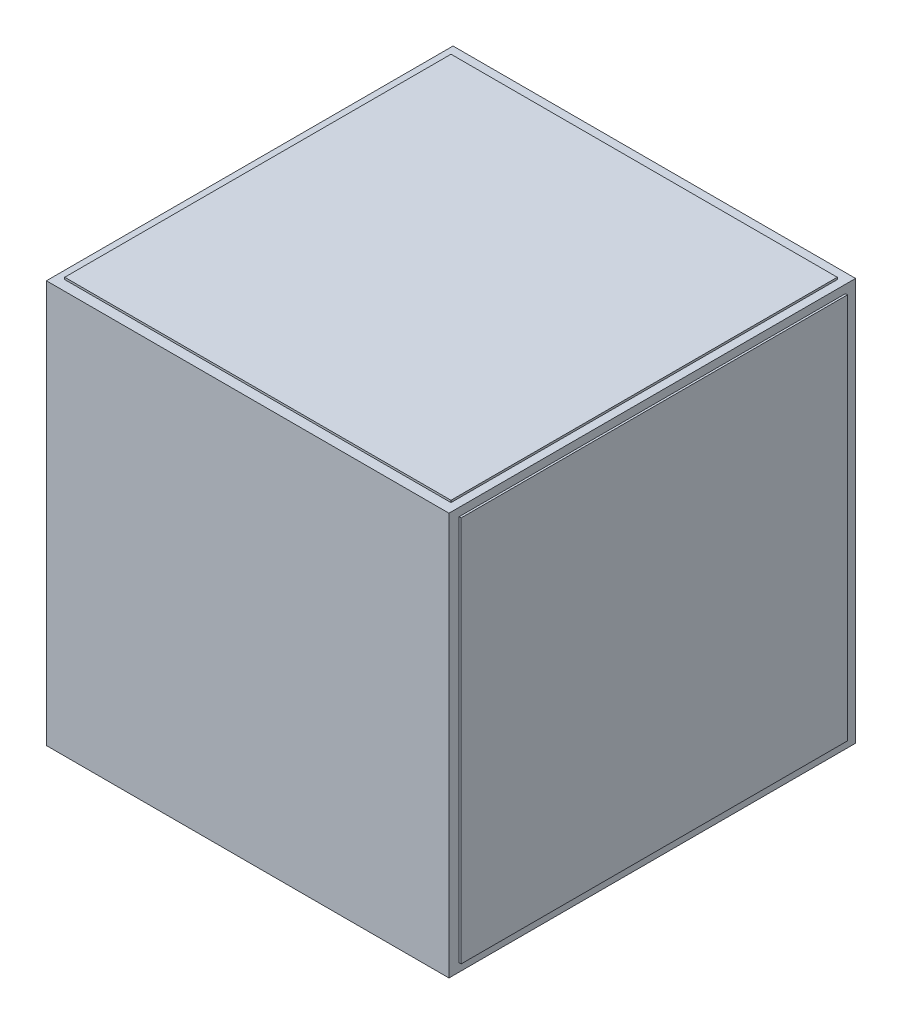
ISO-10303-21;
HEADER;
FILE_DESCRIPTION(('STEP AP214'),'2;1');
FILE_NAME('part.step','',(''),(''),'','','');
FILE_SCHEMA(('AUTOMOTIVE_DESIGN { 1 0 10303 214 1 1 1 1 }'));
ENDSEC;
DATA;
#1=APPLICATION_CONTEXT('core data for automotive mechanical design processes');
#2=APPLICATION_PROTOCOL_DEFINITION('international standard','automotive_design',2000,#1);
#3=PRODUCT_CONTEXT('',#1,'mechanical');
#4=PRODUCT('Part','Part','',(#3));
#5=PRODUCT_RELATED_PRODUCT_CATEGORY('part','',(#4));
#6=PRODUCT_DEFINITION_FORMATION('','',#4);
#7=PRODUCT_DEFINITION_CONTEXT('part definition',#1,'design');
#8=PRODUCT_DEFINITION('design','',#6,#7);
#9=PRODUCT_DEFINITION_SHAPE('','',#8);
#10=(LENGTH_UNIT() NAMED_UNIT(*) SI_UNIT(.MILLI.,.METRE.));
#11=(NAMED_UNIT(*) PLANE_ANGLE_UNIT() SI_UNIT($,.RADIAN.));
#12=(NAMED_UNIT(*) SI_UNIT($,.STERADIAN.) SOLID_ANGLE_UNIT());
#13=UNCERTAINTY_MEASURE_WITH_UNIT(LENGTH_MEASURE(1.E-05),#10,'distance_accuracy_value','');
#14=(GEOMETRIC_REPRESENTATION_CONTEXT(3) GLOBAL_UNCERTAINTY_ASSIGNED_CONTEXT((#13)) GLOBAL_UNIT_ASSIGNED_CONTEXT((#10,
#11,#12)) REPRESENTATION_CONTEXT('',''));
#15=CARTESIAN_POINT('',(0.,0.,0.));
#16=DIRECTION('',(0.,0.,1.));
#17=DIRECTION('',(1.,0.,0.));
#18=AXIS2_PLACEMENT_3D('',#15,#16,#17);
#19=CARTESIAN_POINT('',(0.,0.,0.));
#20=DIRECTION('',(0.,1.,0.));
#21=DIRECTION('',(0.,0.,1.));
#22=AXIS2_PLACEMENT_3D('',#19,#20,#21);
#23=PLANE('',#22);
#24=DIRECTION('',(1.,0.,0.));
#25=VECTOR('',#24,1.);
#26=CARTESIAN_POINT('',(500.000000000002,0.,500.));
#27=LINE('',#26,#25);
#28=CARTESIAN_POINT('',(500.000000000002,0.,500.));
#29=VERTEX_POINT('',#28);
#30=CARTESIAN_POINT('',(19500.,0.,500.));
#31=VERTEX_POINT('',#30);
#32=EDGE_CURVE('E205',#29,#31,#27,.T.);
#33=ORIENTED_EDGE('',*,*,#32,.T.);
#34=DIRECTION('',(0.,0.,1.));
#35=VECTOR('',#34,1.);
#36=CARTESIAN_POINT('',(19500.,0.,19500.));
#37=LINE('',#36,#35);
#38=CARTESIAN_POINT('',(19500.,0.,19500.));
#39=VERTEX_POINT('',#38);
#40=EDGE_CURVE('E208',#31,#39,#37,.T.);
#41=ORIENTED_EDGE('',*,*,#40,.T.);
#42=DIRECTION('',(-1.,0.,0.));
#43=VECTOR('',#42,1.);
#44=CARTESIAN_POINT('',(500.,0.,19500.));
#45=LINE('',#44,#43);
#46=CARTESIAN_POINT('',(500.,0.,19500.));
#47=VERTEX_POINT('',#46);
#48=EDGE_CURVE('E230',#39,#47,#45,.T.);
#49=ORIENTED_EDGE('',*,*,#48,.T.);
#50=DIRECTION('',(0.,0.,-1.));
#51=VECTOR('',#50,1.);
#52=CARTESIAN_POINT('',(500.,0.,19500.));
#53=LINE('',#52,#51);
#54=EDGE_CURVE('E69',#47,#29,#53,.T.);
#55=ORIENTED_EDGE('',*,*,#54,.T.);
#56=EDGE_LOOP('',(#33,#41,#49,#55));
#57=FACE_BOUND('',#56,.T.);
#58=ADVANCED_FACE('F65',(#57),#23,.F.);
#59=CARTESIAN_POINT('',(500.000000000002,20000.,500.));
#60=DIRECTION('',(0.,0.,-1.));
#61=DIRECTION('',(-1.,0.,0.));
#62=AXIS2_PLACEMENT_3D('',#59,#60,#61);
#63=PLANE('',#62);
#64=DIRECTION('',(-1.,0.,0.));
#65=VECTOR('',#64,1.);
#66=CARTESIAN_POINT('',(100.,100.,500.));
#67=LINE('',#66,#65);
#68=CARTESIAN_POINT('',(19500.,100.,500.));
#69=VERTEX_POINT('',#68);
#70=CARTESIAN_POINT('',(500.000000000002,100.000000000001,500.));
#71=VERTEX_POINT('',#70);
#72=EDGE_CURVE('E218',#69,#71,#67,.T.);
#73=ORIENTED_EDGE('',*,*,#72,.F.);
#74=DIRECTION('',(0.,-1.,0.));
#75=VECTOR('',#74,1.);
#76=CARTESIAN_POINT('',(19500.,20000.,500.));
#77=LINE('',#76,#75);
#78=EDGE_CURVE('E215',#69,#31,#77,.T.);
#79=ORIENTED_EDGE('',*,*,#78,.T.);
#80=ORIENTED_EDGE('',*,*,#32,.F.);
#81=DIRECTION('',(0.,-1.,0.));
#82=VECTOR('',#81,1.);
#83=CARTESIAN_POINT('',(500.000000000002,20000.,500.));
#84=LINE('',#83,#82);
#85=EDGE_CURVE('E250',#71,#29,#84,.T.);
#86=ORIENTED_EDGE('',*,*,#85,.F.);
#87=EDGE_LOOP('',(#73,#79,#80,#86));
#88=FACE_BOUND('',#87,.T.);
#89=ADVANCED_FACE('F216',(#88),#63,.T.);
#90=CARTESIAN_POINT('',(19500.,20000.,19500.));
#91=DIRECTION('',(1.,0.,0.));
#92=DIRECTION('',(0.,0.,-1.));
#93=AXIS2_PLACEMENT_3D('',#90,#91,#92);
#94=PLANE('',#93);
#95=DIRECTION('',(0.,0.,-1.));
#96=VECTOR('',#95,1.);
#97=CARTESIAN_POINT('',(19500.,100.,20000.));
#98=LINE('',#97,#96);
#99=CARTESIAN_POINT('',(19500.,100.000000000001,19500.));
#100=VERTEX_POINT('',#99);
#101=EDGE_CURVE('E263',#100,#69,#98,.T.);
#102=ORIENTED_EDGE('',*,*,#101,.F.);
#103=DIRECTION('',(0.,-1.,0.));
#104=VECTOR('',#103,1.);
#105=CARTESIAN_POINT('',(19500.,20000.,19500.));
#106=LINE('',#105,#104);
#107=EDGE_CURVE('E227',#100,#39,#106,.T.);
#108=ORIENTED_EDGE('',*,*,#107,.T.);
#109=ORIENTED_EDGE('',*,*,#40,.F.);
#110=ORIENTED_EDGE('',*,*,#78,.F.);
#111=EDGE_LOOP('',(#102,#108,#109,#110));
#112=FACE_BOUND('',#111,.T.);
#113=ADVANCED_FACE('F226',(#112),#94,.T.);
#114=CARTESIAN_POINT('',(500.,20000.,19500.));
#115=DIRECTION('',(0.,0.,1.));
#116=DIRECTION('',(1.,0.,0.));
#117=AXIS2_PLACEMENT_3D('',#114,#115,#116);
#118=PLANE('',#117);
#119=DIRECTION('',(1.,0.,0.));
#120=VECTOR('',#119,1.);
#121=CARTESIAN_POINT('',(100.,100.,19500.));
#122=LINE('',#121,#120);
#123=CARTESIAN_POINT('',(500.,100.000000000001,19500.));
#124=VERTEX_POINT('',#123);
#125=EDGE_CURVE('E266',#124,#100,#122,.T.);
#126=ORIENTED_EDGE('',*,*,#125,.F.);
#127=DIRECTION('',(0.,-1.,0.));
#128=VECTOR('',#127,1.);
#129=CARTESIAN_POINT('',(500.,20000.,19500.));
#130=LINE('',#129,#128);
#131=EDGE_CURVE('E256',#124,#47,#130,.T.);
#132=ORIENTED_EDGE('',*,*,#131,.T.);
#133=ORIENTED_EDGE('',*,*,#48,.F.);
#134=ORIENTED_EDGE('',*,*,#107,.F.);
#135=EDGE_LOOP('',(#126,#132,#133,#134));
#136=FACE_BOUND('',#135,.T.);
#137=ADVANCED_FACE('F464',(#136),#118,.T.);
#138=CARTESIAN_POINT('',(500.,20000.,19500.));
#139=DIRECTION('',(-1.,0.,0.));
#140=DIRECTION('',(0.,0.,1.));
#141=AXIS2_PLACEMENT_3D('',#138,#139,#140);
#142=PLANE('',#141);
#143=DIRECTION('',(0.,0.,1.));
#144=VECTOR('',#143,1.);
#145=CARTESIAN_POINT('',(500.,100.,20000.));
#146=LINE('',#145,#144);
#147=EDGE_CURVE('E270',#71,#124,#146,.T.);
#148=ORIENTED_EDGE('',*,*,#147,.F.);
#149=ORIENTED_EDGE('',*,*,#85,.T.);
#150=ORIENTED_EDGE('',*,*,#54,.F.);
#151=ORIENTED_EDGE('',*,*,#131,.F.);
#152=EDGE_LOOP('',(#148,#149,#150,#151));
#153=FACE_BOUND('',#152,.T.);
#154=ADVANCED_FACE('F462',(#153),#142,.T.);
#155=DIRECTION('',(0.,0.,-1.));
#156=VECTOR('',#155,1.);
#157=CARTESIAN_POINT('',(500.,19900.,20000.));
#158=LINE('',#157,#156);
#159=CARTESIAN_POINT('',(500.,19900.,19500.));
#160=VERTEX_POINT('',#159);
#161=CARTESIAN_POINT('',(500.000000000002,19900.,500.));
#162=VERTEX_POINT('',#161);
#163=EDGE_CURVE('E393',#160,#162,#158,.T.);
#164=ORIENTED_EDGE('',*,*,#163,.F.);
#165=CARTESIAN_POINT('',(500.,20000.,19500.));
#166=VERTEX_POINT('',#165);
#167=EDGE_CURVE('E260',#166,#160,#130,.T.);
#168=ORIENTED_EDGE('',*,*,#167,.F.);
#169=DIRECTION('',(0.,0.,-1.));
#170=VECTOR('',#169,1.);
#171=CARTESIAN_POINT('',(500.,20000.,19500.));
#172=LINE('',#171,#170);
#173=CARTESIAN_POINT('',(500.000000000002,20000.,500.));
#174=VERTEX_POINT('',#173);
#175=EDGE_CURVE('E233',#166,#174,#172,.T.);
#176=ORIENTED_EDGE('',*,*,#175,.T.);
#177=EDGE_CURVE('E224',#174,#162,#84,.T.);
#178=ORIENTED_EDGE('',*,*,#177,.T.);
#179=EDGE_LOOP('',(#164,#168,#176,#178));
#180=FACE_BOUND('',#179,.T.);
#181=ADVANCED_FACE('F470',(#180),#142,.T.);
#182=DIRECTION('',(-1.,0.,0.));
#183=VECTOR('',#182,1.);
#184=CARTESIAN_POINT('',(100.,19900.,19500.));
#185=LINE('',#184,#183);
#186=CARTESIAN_POINT('',(19500.,19900.,19500.));
#187=VERTEX_POINT('',#186);
#188=EDGE_CURVE('E389',#187,#160,#185,.T.);
#189=ORIENTED_EDGE('',*,*,#188,.F.);
#190=CARTESIAN_POINT('',(19500.,20000.,19500.));
#191=VERTEX_POINT('',#190);
#192=EDGE_CURVE('E255',#191,#187,#106,.T.);
#193=ORIENTED_EDGE('',*,*,#192,.F.);
#194=DIRECTION('',(-1.,0.,0.));
#195=VECTOR('',#194,1.);
#196=CARTESIAN_POINT('',(500.,20000.,19500.));
#197=LINE('',#196,#195);
#198=EDGE_CURVE('E246',#191,#166,#197,.T.);
#199=ORIENTED_EDGE('',*,*,#198,.T.);
#200=ORIENTED_EDGE('',*,*,#167,.T.);
#201=EDGE_LOOP('',(#189,#193,#199,#200));
#202=FACE_BOUND('',#201,.T.);
#203=ADVANCED_FACE('F440',(#202),#118,.T.);
#204=DIRECTION('',(0.,0.,1.));
#205=VECTOR('',#204,1.);
#206=CARTESIAN_POINT('',(19500.,19900.,20000.));
#207=LINE('',#206,#205);
#208=CARTESIAN_POINT('',(19500.,19900.,500.));
#209=VERTEX_POINT('',#208);
#210=EDGE_CURVE('E385',#209,#187,#207,.T.);
#211=ORIENTED_EDGE('',*,*,#210,.F.);
#212=CARTESIAN_POINT('',(19500.,20000.,500.));
#213=VERTEX_POINT('',#212);
#214=EDGE_CURVE('E223',#213,#209,#77,.T.);
#215=ORIENTED_EDGE('',*,*,#214,.F.);
#216=DIRECTION('',(0.,0.,1.));
#217=VECTOR('',#216,1.);
#218=CARTESIAN_POINT('',(19500.,20000.,19500.));
#219=LINE('',#218,#217);
#220=EDGE_CURVE('E242',#213,#191,#219,.T.);
#221=ORIENTED_EDGE('',*,*,#220,.T.);
#222=ORIENTED_EDGE('',*,*,#192,.T.);
#223=EDGE_LOOP('',(#211,#215,#221,#222));
#224=FACE_BOUND('',#223,.T.);
#225=ADVANCED_FACE('F472',(#224),#94,.T.);
#226=DIRECTION('',(1.,0.,0.));
#227=VECTOR('',#226,1.);
#228=CARTESIAN_POINT('',(100.,19900.,500.));
#229=LINE('',#228,#227);
#230=EDGE_CURVE('E381',#162,#209,#229,.T.);
#231=ORIENTED_EDGE('',*,*,#230,.F.);
#232=ORIENTED_EDGE('',*,*,#177,.F.);
#233=DIRECTION('',(1.,0.,0.));
#234=VECTOR('',#233,1.);
#235=CARTESIAN_POINT('',(500.000000000002,20000.,500.));
#236=LINE('',#235,#234);
#237=EDGE_CURVE('E238',#174,#213,#236,.T.);
#238=ORIENTED_EDGE('',*,*,#237,.T.);
#239=ORIENTED_EDGE('',*,*,#214,.T.);
#240=EDGE_LOOP('',(#231,#232,#238,#239));
#241=FACE_BOUND('',#240,.T.);
#242=ADVANCED_FACE('F437',(#241),#63,.T.);
#243=CARTESIAN_POINT('',(20000.,19500.,19500.));
#244=DIRECTION('',(0.,1.,0.));
#245=DIRECTION('',(0.,0.,1.));
#246=AXIS2_PLACEMENT_3D('',#243,#244,#245);
#247=PLANE('',#246);
#248=DIRECTION('',(0.,0.,-1.));
#249=VECTOR('',#248,1.);
#250=CARTESIAN_POINT('',(19900.,19500.,20000.));
#251=LINE('',#250,#249);
#252=CARTESIAN_POINT('',(19900.,19500.,19500.));
#253=VERTEX_POINT('',#252);
#254=CARTESIAN_POINT('',(19900.,19500.,500.));
#255=VERTEX_POINT('',#254);
#256=EDGE_CURVE('E307',#253,#255,#251,.T.);
#257=ORIENTED_EDGE('',*,*,#256,.F.);
#258=DIRECTION('',(-1.,0.,0.));
#259=VECTOR('',#258,1.);
#260=CARTESIAN_POINT('',(20000.,19500.,19500.));
#261=LINE('',#260,#259);
#262=CARTESIAN_POINT('',(20000.,19500.,19500.));
#263=VERTEX_POINT('',#262);
#264=EDGE_CURVE('E291',#263,#253,#261,.T.);
#265=ORIENTED_EDGE('',*,*,#264,.F.);
#266=DIRECTION('',(0.,0.,-1.));
#267=VECTOR('',#266,1.);
#268=CARTESIAN_POINT('',(20000.,19500.,19500.));
#269=LINE('',#268,#267);
#270=CARTESIAN_POINT('',(20000.,19500.,500.));
#271=VERTEX_POINT('',#270);
#272=EDGE_CURVE('E278',#263,#271,#269,.T.);
#273=ORIENTED_EDGE('',*,*,#272,.T.);
#274=DIRECTION('',(-1.,0.,0.));
#275=VECTOR('',#274,1.);
#276=CARTESIAN_POINT('',(20000.,19500.,500.));
#277=LINE('',#276,#275);
#278=EDGE_CURVE('E296',#271,#255,#277,.T.);
#279=ORIENTED_EDGE('',*,*,#278,.T.);
#280=EDGE_LOOP('',(#257,#265,#273,#279));
#281=FACE_BOUND('',#280,.T.);
#282=ADVANCED_FACE('F513',(#281),#247,.T.);
#283=CARTESIAN_POINT('',(20000.,19500.,500.));
#284=DIRECTION('',(0.,0.,-1.));
#285=DIRECTION('',(0.,1.,0.));
#286=AXIS2_PLACEMENT_3D('',#283,#284,#285);
#287=PLANE('',#286);
#288=DIRECTION('',(0.,-1.,0.));
#289=VECTOR('',#288,1.);
#290=CARTESIAN_POINT('',(19900.,99.9999999999963,500.000000000004));
#291=LINE('',#290,#289);
#292=CARTESIAN_POINT('',(19900.,499.999999999998,500.000000000004));
#293=VERTEX_POINT('',#292);
#294=EDGE_CURVE('E315',#255,#293,#291,.T.);
#295=ORIENTED_EDGE('',*,*,#294,.F.);
#296=ORIENTED_EDGE('',*,*,#278,.F.);
#297=DIRECTION('',(0.,-1.,0.));
#298=VECTOR('',#297,1.);
#299=CARTESIAN_POINT('',(20000.,19500.,500.));
#300=LINE('',#299,#298);
#301=CARTESIAN_POINT('',(20000.,499.999999999998,500.000000000004));
#302=VERTEX_POINT('',#301);
#303=EDGE_CURVE('E281',#271,#302,#300,.T.);
#304=ORIENTED_EDGE('',*,*,#303,.T.);
#305=DIRECTION('',(-1.,0.,0.));
#306=VECTOR('',#305,1.);
#307=CARTESIAN_POINT('',(20000.,499.999999999998,500.000000000004));
#308=LINE('',#307,#306);
#309=EDGE_CURVE('E301',#302,#293,#308,.T.);
#310=ORIENTED_EDGE('',*,*,#309,.T.);
#311=EDGE_LOOP('',(#295,#296,#304,#310));
#312=FACE_BOUND('',#311,.T.);
#313=ADVANCED_FACE('F517',(#312),#287,.T.);
#314=CARTESIAN_POINT('',(20000.,500.,19500.));
#315=DIRECTION('',(0.,-1.,0.));
#316=DIRECTION('',(0.,0.,-1.));
#317=AXIS2_PLACEMENT_3D('',#314,#315,#316);
#318=PLANE('',#317);
#319=DIRECTION('',(0.,0.,1.));
#320=VECTOR('',#319,1.);
#321=CARTESIAN_POINT('',(19900.,500.,20000.));
#322=LINE('',#321,#320);
#323=CARTESIAN_POINT('',(19900.,500.,19500.));
#324=VERTEX_POINT('',#323);
#325=EDGE_CURVE('E322',#293,#324,#322,.T.);
#326=ORIENTED_EDGE('',*,*,#325,.F.);
#327=ORIENTED_EDGE('',*,*,#309,.F.);
#328=DIRECTION('',(0.,0.,1.));
#329=VECTOR('',#328,1.);
#330=CARTESIAN_POINT('',(20000.,500.,19500.));
#331=LINE('',#330,#329);
#332=CARTESIAN_POINT('',(20000.,500.,19500.));
#333=VERTEX_POINT('',#332);
#334=EDGE_CURVE('E284',#302,#333,#331,.T.);
#335=ORIENTED_EDGE('',*,*,#334,.T.);
#336=DIRECTION('',(-1.,0.,0.));
#337=VECTOR('',#336,1.);
#338=CARTESIAN_POINT('',(20000.,500.,19500.));
#339=LINE('',#338,#337);
#340=EDGE_CURVE('E306',#333,#324,#339,.T.);
#341=ORIENTED_EDGE('',*,*,#340,.T.);
#342=EDGE_LOOP('',(#326,#327,#335,#341));
#343=FACE_BOUND('',#342,.T.);
#344=ADVANCED_FACE('F502',(#343),#318,.T.);
#345=CARTESIAN_POINT('',(20000.,19500.,19500.));
#346=DIRECTION('',(0.,0.,1.));
#347=DIRECTION('',(0.,-1.,0.));
#348=AXIS2_PLACEMENT_3D('',#345,#346,#347);
#349=PLANE('',#348);
#350=DIRECTION('',(0.,1.,0.));
#351=VECTOR('',#350,1.);
#352=CARTESIAN_POINT('',(19900.,99.9999999999999,19500.));
#353=LINE('',#352,#351);
#354=EDGE_CURVE('E329',#324,#253,#353,.T.);
#355=ORIENTED_EDGE('',*,*,#354,.F.);
#356=ORIENTED_EDGE('',*,*,#340,.F.);
#357=DIRECTION('',(0.,1.,0.));
#358=VECTOR('',#357,1.);
#359=CARTESIAN_POINT('',(20000.,19500.,19500.));
#360=LINE('',#359,#358);
#361=EDGE_CURVE('E274',#333,#263,#360,.T.);
#362=ORIENTED_EDGE('',*,*,#361,.T.);
#363=ORIENTED_EDGE('',*,*,#264,.T.);
#364=EDGE_LOOP('',(#355,#356,#362,#363));
#365=FACE_BOUND('',#364,.T.);
#366=ADVANCED_FACE('F509',(#365),#349,.T.);
#367=CARTESIAN_POINT('',(100.000000000001,19500.,19500.));
#368=VERTEX_POINT('',#367);
#369=CARTESIAN_POINT('',(0.,19500.,19500.));
#370=VERTEX_POINT('',#369);
#371=EDGE_CURVE('E287',#368,#370,#261,.T.);
#372=ORIENTED_EDGE('',*,*,#371,.T.);
#373=DIRECTION('',(0.,-1.,0.));
#374=VECTOR('',#373,1.);
#375=CARTESIAN_POINT('',(0.,0.,19500.));
#376=LINE('',#375,#374);
#377=CARTESIAN_POINT('',(0.,500.,19500.));
#378=VERTEX_POINT('',#377);
#379=EDGE_CURVE('E333',#370,#378,#376,.T.);
#380=ORIENTED_EDGE('',*,*,#379,.T.);
#381=CARTESIAN_POINT('',(100.000000000001,500.,19500.));
#382=VERTEX_POINT('',#381);
#383=EDGE_CURVE('E302',#382,#378,#339,.T.);
#384=ORIENTED_EDGE('',*,*,#383,.F.);
#385=DIRECTION('',(0.,-1.,0.));
#386=VECTOR('',#385,1.);
#387=CARTESIAN_POINT('',(100.,99.9999999999999,19500.));
#388=LINE('',#387,#386);
#389=EDGE_CURVE('E377',#368,#382,#388,.T.);
#390=ORIENTED_EDGE('',*,*,#389,.F.);
#391=EDGE_LOOP('',(#372,#380,#384,#390));
#392=FACE_BOUND('',#391,.T.);
#393=ADVANCED_FACE('F603',(#392),#349,.T.);
#394=ORIENTED_EDGE('',*,*,#383,.T.);
#395=DIRECTION('',(0.,0.,-1.));
#396=VECTOR('',#395,1.);
#397=CARTESIAN_POINT('',(0.,500.,20000.));
#398=LINE('',#397,#396);
#399=CARTESIAN_POINT('',(0.,499.999999999998,500.000000000004));
#400=VERTEX_POINT('',#399);
#401=EDGE_CURVE('E326',#378,#400,#398,.T.);
#402=ORIENTED_EDGE('',*,*,#401,.T.);
#403=CARTESIAN_POINT('',(100.000000000001,499.999999999998,500.000000000004));
#404=VERTEX_POINT('',#403);
#405=EDGE_CURVE('E297',#404,#400,#308,.T.);
#406=ORIENTED_EDGE('',*,*,#405,.F.);
#407=DIRECTION('',(0.,0.,-1.));
#408=VECTOR('',#407,1.);
#409=CARTESIAN_POINT('',(100.,500.,20000.));
#410=LINE('',#409,#408);
#411=EDGE_CURVE('E373',#382,#404,#410,.T.);
#412=ORIENTED_EDGE('',*,*,#411,.F.);
#413=EDGE_LOOP('',(#394,#402,#406,#412));
#414=FACE_BOUND('',#413,.T.);
#415=ADVANCED_FACE('F596',(#414),#318,.T.);
#416=ORIENTED_EDGE('',*,*,#405,.T.);
#417=DIRECTION('',(0.,1.,0.));
#418=VECTOR('',#417,1.);
#419=CARTESIAN_POINT('',(0.,-3.70317811503259E-12,500.000000000004));
#420=LINE('',#419,#418);
#421=CARTESIAN_POINT('',(0.,19500.,500.));
#422=VERTEX_POINT('',#421);
#423=EDGE_CURVE('E319',#400,#422,#420,.T.);
#424=ORIENTED_EDGE('',*,*,#423,.T.);
#425=CARTESIAN_POINT('',(100.,19500.,500.));
#426=VERTEX_POINT('',#425);
#427=EDGE_CURVE('E292',#426,#422,#277,.T.);
#428=ORIENTED_EDGE('',*,*,#427,.F.);
#429=DIRECTION('',(0.,1.,0.));
#430=VECTOR('',#429,1.);
#431=CARTESIAN_POINT('',(100.,99.9999999999963,500.000000000004));
#432=LINE('',#431,#430);
#433=EDGE_CURVE('E369',#404,#426,#432,.T.);
#434=ORIENTED_EDGE('',*,*,#433,.F.);
#435=EDGE_LOOP('',(#416,#424,#428,#434));
#436=FACE_BOUND('',#435,.T.);
#437=ADVANCED_FACE('F602',(#436),#287,.T.);
#438=ORIENTED_EDGE('',*,*,#427,.T.);
#439=DIRECTION('',(0.,0.,1.));
#440=VECTOR('',#439,1.);
#441=CARTESIAN_POINT('',(0.,19500.,20000.));
#442=LINE('',#441,#440);
#443=EDGE_CURVE('E311',#422,#370,#442,.T.);
#444=ORIENTED_EDGE('',*,*,#443,.T.);
#445=ORIENTED_EDGE('',*,*,#371,.F.);
#446=DIRECTION('',(0.,0.,1.));
#447=VECTOR('',#446,1.);
#448=CARTESIAN_POINT('',(100.,19500.,20000.));
#449=LINE('',#448,#447);
#450=EDGE_CURVE('E365',#426,#368,#449,.T.);
#451=ORIENTED_EDGE('',*,*,#450,.F.);
#452=EDGE_LOOP('',(#438,#444,#445,#451));
#453=FACE_BOUND('',#452,.T.);
#454=ADVANCED_FACE('F426',(#453),#247,.T.);
#455=CARTESIAN_POINT('',(100.,100.,20000.));
#456=DIRECTION('',(1.,0.,0.));
#457=DIRECTION('',(0.,0.,-1.));
#458=AXIS2_PLACEMENT_3D('',#455,#456,#457);
#459=PLANE('',#458);
#460=ORIENTED_EDGE('',*,*,#389,.T.);
#461=ORIENTED_EDGE('',*,*,#411,.T.);
#462=ORIENTED_EDGE('',*,*,#433,.T.);
#463=ORIENTED_EDGE('',*,*,#450,.T.);
#464=EDGE_LOOP('',(#460,#461,#462,#463));
#465=FACE_BOUND('',#464,.T.);
#466=DIRECTION('',(0.,-1.,0.));
#467=VECTOR('',#466,1.);
#468=CARTESIAN_POINT('',(100.,100.,0.));
#469=LINE('',#468,#467);
#470=CARTESIAN_POINT('',(100.,19900.,0.));
#471=VERTEX_POINT('',#470);
#472=CARTESIAN_POINT('',(100.,100.,0.));
#473=VERTEX_POINT('',#472);
#474=EDGE_CURVE('E348',#471,#473,#469,.T.);
#475=ORIENTED_EDGE('',*,*,#474,.T.);
#476=DIRECTION('',(0.,0.,-1.));
#477=VECTOR('',#476,1.);
#478=CARTESIAN_POINT('',(100.,100.,20000.));
#479=LINE('',#478,#477);
#480=CARTESIAN_POINT('',(100.,100.,20000.));
#481=VERTEX_POINT('',#480);
#482=EDGE_CURVE('E351',#481,#473,#479,.T.);
#483=ORIENTED_EDGE('',*,*,#482,.F.);
#484=DIRECTION('',(0.,-1.,0.));
#485=VECTOR('',#484,1.);
#486=CARTESIAN_POINT('',(100.,100.,20000.));
#487=LINE('',#486,#485);
#488=CARTESIAN_POINT('',(100.,19900.,20000.));
#489=VERTEX_POINT('',#488);
#490=EDGE_CURVE('E396',#489,#481,#487,.T.);
#491=ORIENTED_EDGE('',*,*,#490,.F.);
#492=DIRECTION('',(0.,0.,-1.));
#493=VECTOR('',#492,1.);
#494=CARTESIAN_POINT('',(100.,19900.,20000.));
#495=LINE('',#494,#493);
#496=EDGE_CURVE('E355',#489,#471,#495,.T.);
#497=ORIENTED_EDGE('',*,*,#496,.T.);
#498=EDGE_LOOP('',(#475,#483,#491,#497));
#499=FACE_BOUND('',#498,.T.);
#500=ADVANCED_FACE('F409',(#465,#499),#459,.F.);
#501=CARTESIAN_POINT('',(100.,19900.,20000.));
#502=DIRECTION('',(0.,-1.,0.));
#503=DIRECTION('',(0.,0.,-1.));
#504=AXIS2_PLACEMENT_3D('',#501,#502,#503);
#505=PLANE('',#504);
#506=ORIENTED_EDGE('',*,*,#163,.T.);
#507=ORIENTED_EDGE('',*,*,#230,.T.);
#508=ORIENTED_EDGE('',*,*,#210,.T.);
#509=ORIENTED_EDGE('',*,*,#188,.T.);
#510=EDGE_LOOP('',(#506,#507,#508,#509));
#511=FACE_BOUND('',#510,.T.);
#512=DIRECTION('',(-1.,0.,0.));
#513=VECTOR('',#512,1.);
#514=CARTESIAN_POINT('',(100.,19900.,0.));
#515=LINE('',#514,#513);
#516=CARTESIAN_POINT('',(19900.,19900.,0.));
#517=VERTEX_POINT('',#516);
#518=EDGE_CURVE('E344',#517,#471,#515,.T.);
#519=ORIENTED_EDGE('',*,*,#518,.T.);
#520=ORIENTED_EDGE('',*,*,#496,.F.);
#521=DIRECTION('',(-1.,0.,0.));
#522=VECTOR('',#521,1.);
#523=CARTESIAN_POINT('',(100.,19900.,20000.));
#524=LINE('',#523,#522);
#525=CARTESIAN_POINT('',(19900.,19900.,20000.));
#526=VERTEX_POINT('',#525);
#527=EDGE_CURVE('E89',#526,#489,#524,.T.);
#528=ORIENTED_EDGE('',*,*,#527,.F.);
#529=DIRECTION('',(0.,0.,-1.));
#530=VECTOR('',#529,1.);
#531=CARTESIAN_POINT('',(19900.,19900.,20000.));
#532=LINE('',#531,#530);
#533=EDGE_CURVE('E359',#526,#517,#532,.T.);
#534=ORIENTED_EDGE('',*,*,#533,.T.);
#535=EDGE_LOOP('',(#519,#520,#528,#534));
#536=FACE_BOUND('',#535,.T.);
#537=ADVANCED_FACE('F416',(#511,#536),#505,.F.);
#538=CARTESIAN_POINT('',(19900.,100.,20000.));
#539=DIRECTION('',(-1.,0.,0.));
#540=DIRECTION('',(0.,0.,1.));
#541=AXIS2_PLACEMENT_3D('',#538,#539,#540);
#542=PLANE('',#541);
#543=ORIENTED_EDGE('',*,*,#354,.T.);
#544=ORIENTED_EDGE('',*,*,#256,.T.);
#545=ORIENTED_EDGE('',*,*,#294,.T.);
#546=ORIENTED_EDGE('',*,*,#325,.T.);
#547=EDGE_LOOP('',(#543,#544,#545,#546));
#548=FACE_BOUND('',#547,.T.);
#549=DIRECTION('',(0.,1.,0.));
#550=VECTOR('',#549,1.);
#551=CARTESIAN_POINT('',(19900.,100.,0.));
#552=LINE('',#551,#550);
#553=CARTESIAN_POINT('',(19900.,100.,0.));
#554=VERTEX_POINT('',#553);
#555=EDGE_CURVE('E340',#554,#517,#552,.T.);
#556=ORIENTED_EDGE('',*,*,#555,.T.);
#557=ORIENTED_EDGE('',*,*,#533,.F.);
#558=DIRECTION('',(0.,1.,0.));
#559=VECTOR('',#558,1.);
#560=CARTESIAN_POINT('',(19900.,100.,20000.));
#561=LINE('',#560,#559);
#562=CARTESIAN_POINT('',(19900.,100.,20000.));
#563=VERTEX_POINT('',#562);
#564=EDGE_CURVE('E75',#563,#526,#561,.T.);
#565=ORIENTED_EDGE('',*,*,#564,.F.);
#566=DIRECTION('',(0.,0.,-1.));
#567=VECTOR('',#566,1.);
#568=CARTESIAN_POINT('',(19900.,100.,20000.));
#569=LINE('',#568,#567);
#570=EDGE_CURVE('E362',#563,#554,#569,.T.);
#571=ORIENTED_EDGE('',*,*,#570,.T.);
#572=EDGE_LOOP('',(#556,#557,#565,#571));
#573=FACE_BOUND('',#572,.T.);
#574=ADVANCED_FACE('F413',(#548,#573),#542,.F.);
#575=CARTESIAN_POINT('',(100.,100.,20000.));
#576=DIRECTION('',(0.,1.,0.));
#577=DIRECTION('',(0.,0.,1.));
#578=AXIS2_PLACEMENT_3D('',#575,#576,#577);
#579=PLANE('',#578);
#580=ORIENTED_EDGE('',*,*,#147,.T.);
#581=ORIENTED_EDGE('',*,*,#125,.T.);
#582=ORIENTED_EDGE('',*,*,#101,.T.);
#583=ORIENTED_EDGE('',*,*,#72,.T.);
#584=EDGE_LOOP('',(#580,#581,#582,#583));
#585=FACE_BOUND('',#584,.T.);
#586=DIRECTION('',(1.,0.,0.));
#587=VECTOR('',#586,1.);
#588=CARTESIAN_POINT('',(100.,100.,0.));
#589=LINE('',#588,#587);
#590=EDGE_CURVE('E336',#473,#554,#589,.T.);
#591=ORIENTED_EDGE('',*,*,#590,.T.);
#592=ORIENTED_EDGE('',*,*,#570,.F.);
#593=DIRECTION('',(1.,0.,0.));
#594=VECTOR('',#593,1.);
#595=CARTESIAN_POINT('',(100.,100.,20000.));
#596=LINE('',#595,#594);
#597=EDGE_CURVE('E12',#481,#563,#596,.T.);
#598=ORIENTED_EDGE('',*,*,#597,.F.);
#599=ORIENTED_EDGE('',*,*,#482,.T.);
#600=EDGE_LOOP('',(#591,#592,#598,#599));
#601=FACE_BOUND('',#600,.T.);
#602=ADVANCED_FACE('F412',(#585,#601),#579,.F.);
#603=CARTESIAN_POINT('',(0.,20000.,0.));
#604=DIRECTION('',(0.,1.,0.));
#605=DIRECTION('',(0.,0.,1.));
#606=AXIS2_PLACEMENT_3D('',#603,#604,#605);
#607=PLANE('',#606);
#608=ORIENTED_EDGE('',*,*,#198,.F.);
#609=ORIENTED_EDGE('',*,*,#220,.F.);
#610=ORIENTED_EDGE('',*,*,#237,.F.);
#611=ORIENTED_EDGE('',*,*,#175,.F.);
#612=EDGE_LOOP('',(#608,#609,#610,#611));
#613=FACE_BOUND('',#612,.T.);
#614=ADVANCED_FACE('F442',(#613),#607,.T.);
#615=CARTESIAN_POINT('',(20000.,0.,0.));
#616=DIRECTION('',(1.,0.,0.));
#617=DIRECTION('',(0.,0.,-1.));
#618=AXIS2_PLACEMENT_3D('',#615,#616,#617);
#619=PLANE('',#618);
#620=ORIENTED_EDGE('',*,*,#334,.F.);
#621=ORIENTED_EDGE('',*,*,#303,.F.);
#622=ORIENTED_EDGE('',*,*,#272,.F.);
#623=ORIENTED_EDGE('',*,*,#361,.F.);
#624=EDGE_LOOP('',(#620,#621,#622,#623));
#625=FACE_BOUND('',#624,.T.);
#626=ADVANCED_FACE('F67',(#625),#619,.T.);
#627=CARTESIAN_POINT('',(0.,0.,0.));
#628=DIRECTION('',(-1.,0.,0.));
#629=DIRECTION('',(0.,0.,1.));
#630=AXIS2_PLACEMENT_3D('',#627,#628,#629);
#631=PLANE('',#630);
#632=ORIENTED_EDGE('',*,*,#443,.F.);
#633=ORIENTED_EDGE('',*,*,#423,.F.);
#634=ORIENTED_EDGE('',*,*,#401,.F.);
#635=ORIENTED_EDGE('',*,*,#379,.F.);
#636=EDGE_LOOP('',(#632,#633,#634,#635));
#637=FACE_BOUND('',#636,.T.);
#638=ADVANCED_FACE('F445',(#637),#631,.T.);
#639=CARTESIAN_POINT('',(0.,0.,0.));
#640=DIRECTION('',(0.,0.,-1.));
#641=DIRECTION('',(-1.,0.,0.));
#642=AXIS2_PLACEMENT_3D('',#639,#640,#641);
#643=PLANE('',#642);
#644=ORIENTED_EDGE('',*,*,#474,.F.);
#645=ORIENTED_EDGE('',*,*,#518,.F.);
#646=ORIENTED_EDGE('',*,*,#555,.F.);
#647=ORIENTED_EDGE('',*,*,#590,.F.);
#648=EDGE_LOOP('',(#644,#645,#646,#647));
#649=FACE_BOUND('',#648,.T.);
#650=ADVANCED_FACE('F415',(#649),#643,.T.);
#651=CARTESIAN_POINT('',(0.,0.,20000.));
#652=DIRECTION('',(0.,0.,1.));
#653=DIRECTION('',(1.,0.,0.));
#654=AXIS2_PLACEMENT_3D('',#651,#652,#653);
#655=PLANE('',#654);
#656=ORIENTED_EDGE('',*,*,#490,.T.);
#657=ORIENTED_EDGE('',*,*,#597,.T.);
#658=ORIENTED_EDGE('',*,*,#564,.T.);
#659=ORIENTED_EDGE('',*,*,#527,.T.);
#660=EDGE_LOOP('',(#656,#657,#658,#659));
#661=FACE_BOUND('',#660,.T.);
#662=ADVANCED_FACE('F405',(#661),#655,.T.);
#663=CLOSED_SHELL('',(#58,#89,#113,#137,#154,#181,#203,#225,#242,#282,#313,#344,#366,#393,#415,
#437,#454,#500,#537,#574,#602,#614,#626,#638,#650,#662));
#664=MANIFOLD_SOLID_BREP('B2',#663);
#665=ADVANCED_BREP_SHAPE_REPRESENTATION('',(#18,#664),#14);
#666=SHAPE_DEFINITION_REPRESENTATION(#9,#665);
ENDSEC;
END-ISO-10303-21;
